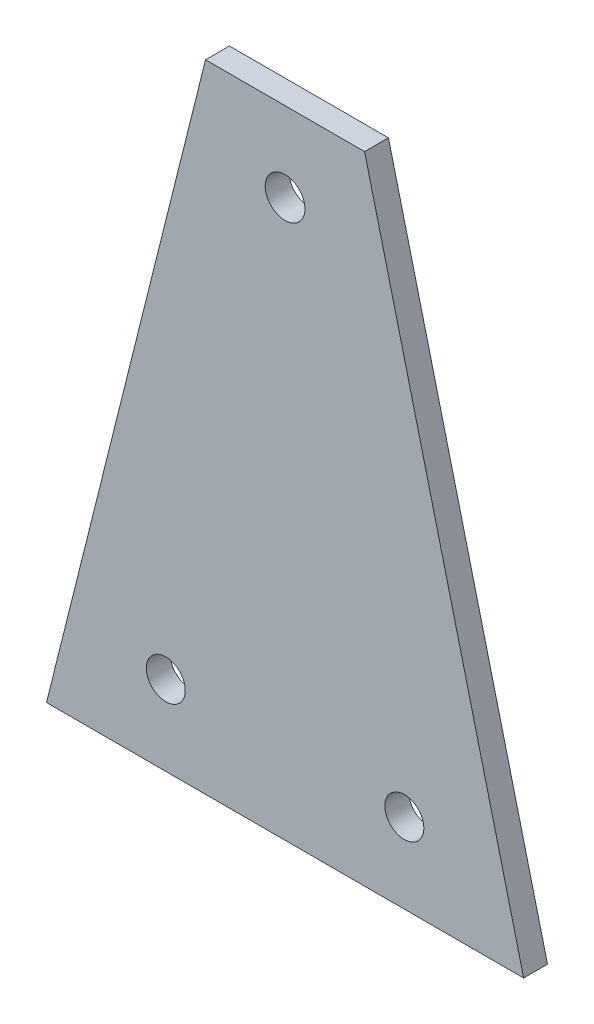
ISO-10303-21;
HEADER;
FILE_DESCRIPTION(('STEP AP214'),'2;1');
FILE_NAME('part.step','',(''),(''),'','','');
FILE_SCHEMA(('AUTOMOTIVE_DESIGN { 1 0 10303 214 1 1 1 1 }'));
ENDSEC;
DATA;
#1=APPLICATION_CONTEXT('core data for automotive mechanical design processes');
#2=APPLICATION_PROTOCOL_DEFINITION('international standard','automotive_design',2000,#1);
#3=PRODUCT_CONTEXT('',#1,'mechanical');
#4=PRODUCT('Part','Part','',(#3));
#5=PRODUCT_RELATED_PRODUCT_CATEGORY('part','',(#4));
#6=PRODUCT_DEFINITION_FORMATION('','',#4);
#7=PRODUCT_DEFINITION_CONTEXT('part definition',#1,'design');
#8=PRODUCT_DEFINITION('design','',#6,#7);
#9=PRODUCT_DEFINITION_SHAPE('','',#8);
#10=(LENGTH_UNIT() NAMED_UNIT(*) SI_UNIT(.MILLI.,.METRE.));
#11=(NAMED_UNIT(*) PLANE_ANGLE_UNIT() SI_UNIT($,.RADIAN.));
#12=(NAMED_UNIT(*) SI_UNIT($,.STERADIAN.) SOLID_ANGLE_UNIT());
#13=UNCERTAINTY_MEASURE_WITH_UNIT(LENGTH_MEASURE(1.E-05),#10,'distance_accuracy_value','');
#14=(GEOMETRIC_REPRESENTATION_CONTEXT(3) GLOBAL_UNCERTAINTY_ASSIGNED_CONTEXT((#13)) GLOBAL_UNIT_ASSIGNED_CONTEXT((#10,
#11,#12)) REPRESENTATION_CONTEXT('',''));
#15=CARTESIAN_POINT('',(0.,0.,0.));
#16=DIRECTION('',(0.,0.,1.));
#17=DIRECTION('',(1.,0.,0.));
#18=AXIS2_PLACEMENT_3D('',#15,#16,#17);
#19=CARTESIAN_POINT('',(0.,0.,3.));
#20=DIRECTION('',(0.,0.,-1.));
#21=DIRECTION('',(-1.,0.,0.));
#22=AXIS2_PLACEMENT_3D('',#19,#20,#21);
#23=PLANE('',#22);
#24=DIRECTION('',(-0.242535625036333,0.970142500145332,0.));
#25=VECTOR('',#24,1.);
#26=CARTESIAN_POINT('',(10.,0.,3.));
#27=LINE('',#26,#25);
#28=CARTESIAN_POINT('',(30.,-80.,3.));
#29=VERTEX_POINT('',#28);
#30=CARTESIAN_POINT('',(10.,0.,3.));
#31=VERTEX_POINT('',#30);
#32=EDGE_CURVE('E85',#29,#31,#27,.T.);
#33=ORIENTED_EDGE('',*,*,#32,.T.);
#34=DIRECTION('',(-1.,0.,0.));
#35=VECTOR('',#34,1.);
#36=CARTESIAN_POINT('',(-10.,0.,3.));
#37=LINE('',#36,#35);
#38=CARTESIAN_POINT('',(-10.,0.,3.));
#39=VERTEX_POINT('',#38);
#40=EDGE_CURVE('E80',#31,#39,#37,.T.);
#41=ORIENTED_EDGE('',*,*,#40,.T.);
#42=DIRECTION('',(-0.242535625036333,-0.970142500145332,0.));
#43=VECTOR('',#42,1.);
#44=CARTESIAN_POINT('',(-10.,0.,3.));
#45=LINE('',#44,#43);
#46=CARTESIAN_POINT('',(-30.,-80.,3.));
#47=VERTEX_POINT('',#46);
#48=EDGE_CURVE('E83',#39,#47,#45,.T.);
#49=ORIENTED_EDGE('',*,*,#48,.T.);
#50=DIRECTION('',(1.,0.,0.));
#51=VECTOR('',#50,1.);
#52=CARTESIAN_POINT('',(30.,-80.,3.));
#53=LINE('',#52,#51);
#54=EDGE_CURVE('E50',#47,#29,#53,.T.);
#55=ORIENTED_EDGE('',*,*,#54,.T.);
#56=EDGE_LOOP('',(#33,#41,#49,#55));
#57=FACE_BOUND('',#56,.T.);
#58=CARTESIAN_POINT('',(0.,-10.,3.));
#59=DIRECTION('',(0.,0.,1.));
#60=DIRECTION('',(1.,0.,0.));
#61=AXIS2_PLACEMENT_3D('',#58,#59,#60);
#62=CIRCLE('',#61,2.5);
#63=CARTESIAN_POINT('',(2.5,-10.,3.));
#64=VERTEX_POINT('',#63);
#65=EDGE_CURVE('E100',#64,#64,#62,.T.);
#66=ORIENTED_EDGE('',*,*,#65,.F.);
#67=EDGE_LOOP('',(#66));
#68=FACE_BOUND('',#67,.T.);
#69=CARTESIAN_POINT('',(15.,-69.97,3.));
#70=DIRECTION('',(0.,0.,1.));
#71=DIRECTION('',(1.,0.,0.));
#72=AXIS2_PLACEMENT_3D('',#69,#70,#71);
#73=CIRCLE('',#72,2.44999999999999);
#74=CARTESIAN_POINT('',(17.45,-69.97,3.));
#75=VERTEX_POINT('',#74);
#76=EDGE_CURVE('E115',#75,#75,#73,.T.);
#77=ORIENTED_EDGE('',*,*,#76,.F.);
#78=EDGE_LOOP('',(#77));
#79=FACE_BOUND('',#78,.T.);
#80=CARTESIAN_POINT('',(-15.,-69.97,3.));
#81=DIRECTION('',(0.,0.,1.));
#82=DIRECTION('',(-1.,0.,0.));
#83=AXIS2_PLACEMENT_3D('',#80,#81,#82);
#84=CIRCLE('',#83,2.44999999999999);
#85=CARTESIAN_POINT('',(-17.45,-69.97,3.));
#86=VERTEX_POINT('',#85);
#87=EDGE_CURVE('E121',#86,#86,#84,.T.);
#88=ORIENTED_EDGE('',*,*,#87,.F.);
#89=EDGE_LOOP('',(#88));
#90=FACE_BOUND('',#89,.T.);
#91=ADVANCED_FACE('F33',(#57,#68,#79,#90),#23,.F.);
#92=CARTESIAN_POINT('',(0.,0.,0.));
#93=DIRECTION('',(0.,0.,-1.));
#94=DIRECTION('',(-1.,0.,0.));
#95=AXIS2_PLACEMENT_3D('',#92,#93,#94);
#96=PLANE('',#95);
#97=CARTESIAN_POINT('',(15.,-69.97,0.));
#98=DIRECTION('',(0.,0.,1.));
#99=DIRECTION('',(1.,0.,0.));
#100=AXIS2_PLACEMENT_3D('',#97,#98,#99);
#101=CIRCLE('',#100,2.44999999999999);
#102=CARTESIAN_POINT('',(17.45,-69.97,0.));
#103=VERTEX_POINT('',#102);
#104=EDGE_CURVE('E118',#103,#103,#101,.T.);
#105=ORIENTED_EDGE('',*,*,#104,.T.);
#106=EDGE_LOOP('',(#105));
#107=FACE_BOUND('',#106,.T.);
#108=DIRECTION('',(-0.242535625036333,0.970142500145332,0.));
#109=VECTOR('',#108,1.);
#110=CARTESIAN_POINT('',(10.,0.,0.));
#111=LINE('',#110,#109);
#112=CARTESIAN_POINT('',(30.,-80.,0.));
#113=VERTEX_POINT('',#112);
#114=CARTESIAN_POINT('',(10.,0.,0.));
#115=VERTEX_POINT('',#114);
#116=EDGE_CURVE('E97',#113,#115,#111,.T.);
#117=ORIENTED_EDGE('',*,*,#116,.F.);
#118=DIRECTION('',(1.,0.,0.));
#119=VECTOR('',#118,1.);
#120=CARTESIAN_POINT('',(30.,-80.,0.));
#121=LINE('',#120,#119);
#122=CARTESIAN_POINT('',(-30.,-80.,0.));
#123=VERTEX_POINT('',#122);
#124=EDGE_CURVE('E73',#123,#113,#121,.T.);
#125=ORIENTED_EDGE('',*,*,#124,.F.);
#126=DIRECTION('',(-0.242535625036333,-0.970142500145332,0.));
#127=VECTOR('',#126,1.);
#128=CARTESIAN_POINT('',(-10.,0.,0.));
#129=LINE('',#128,#127);
#130=CARTESIAN_POINT('',(-10.,0.,0.));
#131=VERTEX_POINT('',#130);
#132=EDGE_CURVE('E67',#131,#123,#129,.T.);
#133=ORIENTED_EDGE('',*,*,#132,.F.);
#134=DIRECTION('',(-1.,0.,0.));
#135=VECTOR('',#134,1.);
#136=CARTESIAN_POINT('',(-10.,0.,0.));
#137=LINE('',#136,#135);
#138=EDGE_CURVE('E89',#115,#131,#137,.T.);
#139=ORIENTED_EDGE('',*,*,#138,.F.);
#140=EDGE_LOOP('',(#117,#125,#133,#139));
#141=FACE_BOUND('',#140,.T.);
#142=CARTESIAN_POINT('',(0.,-10.,0.));
#143=DIRECTION('',(0.,0.,1.));
#144=DIRECTION('',(1.,0.,0.));
#145=AXIS2_PLACEMENT_3D('',#142,#143,#144);
#146=CIRCLE('',#145,2.5);
#147=CARTESIAN_POINT('',(2.5,-10.,0.));
#148=VERTEX_POINT('',#147);
#149=EDGE_CURVE('E112',#148,#148,#146,.T.);
#150=ORIENTED_EDGE('',*,*,#149,.T.);
#151=EDGE_LOOP('',(#150));
#152=FACE_BOUND('',#151,.T.);
#153=CARTESIAN_POINT('',(-15.,-69.97,0.));
#154=DIRECTION('',(0.,0.,1.));
#155=DIRECTION('',(-1.,0.,0.));
#156=AXIS2_PLACEMENT_3D('',#153,#154,#155);
#157=CIRCLE('',#156,2.44999999999999);
#158=CARTESIAN_POINT('',(-17.45,-69.97,0.));
#159=VERTEX_POINT('',#158);
#160=EDGE_CURVE('E124',#159,#159,#157,.T.);
#161=ORIENTED_EDGE('',*,*,#160,.T.);
#162=EDGE_LOOP('',(#161));
#163=FACE_BOUND('',#162,.T.);
#164=ADVANCED_FACE('F108',(#107,#141,#152,#163),#96,.T.);
#165=CARTESIAN_POINT('',(10.,0.,3.));
#166=DIRECTION('',(-0.970142500145332,-0.242535625036333,0.));
#167=DIRECTION('',(0.242535625036333,-0.970142500145332,0.));
#168=AXIS2_PLACEMENT_3D('',#165,#166,#167);
#169=PLANE('',#168);
#170=ORIENTED_EDGE('',*,*,#116,.T.);
#171=DIRECTION('',(0.,0.,-1.));
#172=VECTOR('',#171,1.);
#173=CARTESIAN_POINT('',(10.,0.,3.));
#174=LINE('',#173,#172);
#175=EDGE_CURVE('E11',#31,#115,#174,.T.);
#176=ORIENTED_EDGE('',*,*,#175,.F.);
#177=ORIENTED_EDGE('',*,*,#32,.F.);
#178=DIRECTION('',(0.,0.,-1.));
#179=VECTOR('',#178,1.);
#180=CARTESIAN_POINT('',(30.,-80.,3.));
#181=LINE('',#180,#179);
#182=EDGE_CURVE('E93',#29,#113,#181,.T.);
#183=ORIENTED_EDGE('',*,*,#182,.T.);
#184=EDGE_LOOP('',(#170,#176,#177,#183));
#185=FACE_BOUND('',#184,.T.);
#186=ADVANCED_FACE('F35',(#185),#169,.F.);
#187=CARTESIAN_POINT('',(-10.,0.,3.));
#188=DIRECTION('',(0.,-1.,0.));
#189=DIRECTION('',(0.,0.,-1.));
#190=AXIS2_PLACEMENT_3D('',#187,#188,#189);
#191=PLANE('',#190);
#192=ORIENTED_EDGE('',*,*,#138,.T.);
#193=DIRECTION('',(0.,0.,-1.));
#194=VECTOR('',#193,1.);
#195=CARTESIAN_POINT('',(-10.,0.,3.));
#196=LINE('',#195,#194);
#197=EDGE_CURVE('E42',#39,#131,#196,.T.);
#198=ORIENTED_EDGE('',*,*,#197,.F.);
#199=ORIENTED_EDGE('',*,*,#40,.F.);
#200=ORIENTED_EDGE('',*,*,#175,.T.);
#201=EDGE_LOOP('',(#192,#198,#199,#200));
#202=FACE_BOUND('',#201,.T.);
#203=ADVANCED_FACE('F88',(#202),#191,.F.);
#204=CARTESIAN_POINT('',(-10.,0.,3.));
#205=DIRECTION('',(0.970142500145332,-0.242535625036333,0.));
#206=DIRECTION('',(0.242535625036333,0.970142500145332,0.));
#207=AXIS2_PLACEMENT_3D('',#204,#205,#206);
#208=PLANE('',#207);
#209=ORIENTED_EDGE('',*,*,#132,.T.);
#210=DIRECTION('',(0.,0.,-1.));
#211=VECTOR('',#210,1.);
#212=CARTESIAN_POINT('',(-30.,-80.,3.));
#213=LINE('',#212,#211);
#214=EDGE_CURVE('E90',#47,#123,#213,.T.);
#215=ORIENTED_EDGE('',*,*,#214,.F.);
#216=ORIENTED_EDGE('',*,*,#48,.F.);
#217=ORIENTED_EDGE('',*,*,#197,.T.);
#218=EDGE_LOOP('',(#209,#215,#216,#217));
#219=FACE_BOUND('',#218,.T.);
#220=ADVANCED_FACE('F91',(#219),#208,.F.);
#221=CARTESIAN_POINT('',(30.,-80.,3.));
#222=DIRECTION('',(0.,1.,0.));
#223=DIRECTION('',(0.,0.,1.));
#224=AXIS2_PLACEMENT_3D('',#221,#222,#223);
#225=PLANE('',#224);
#226=ORIENTED_EDGE('',*,*,#124,.T.);
#227=ORIENTED_EDGE('',*,*,#182,.F.);
#228=ORIENTED_EDGE('',*,*,#54,.F.);
#229=ORIENTED_EDGE('',*,*,#214,.T.);
#230=EDGE_LOOP('',(#226,#227,#228,#229));
#231=FACE_BOUND('',#230,.T.);
#232=ADVANCED_FACE('F105',(#231),#225,.F.);
#233=CARTESIAN_POINT('',(0.,-10.,3.));
#234=DIRECTION('',(0.,0.,-1.));
#235=DIRECTION('',(-1.,0.,0.));
#236=AXIS2_PLACEMENT_3D('',#233,#234,#235);
#237=CYLINDRICAL_SURFACE('',#236,2.5);
#238=ORIENTED_EDGE('',*,*,#65,.T.);
#239=EDGE_LOOP('',(#238));
#240=FACE_BOUND('',#239,.T.);
#241=ORIENTED_EDGE('',*,*,#149,.F.);
#242=EDGE_LOOP('',(#241));
#243=FACE_BOUND('',#242,.T.);
#244=ADVANCED_FACE('F141',(#240,#243),#237,.F.);
#245=CARTESIAN_POINT('',(15.,-69.97,3.));
#246=DIRECTION('',(0.,0.,-1.));
#247=DIRECTION('',(-1.,0.,0.));
#248=AXIS2_PLACEMENT_3D('',#245,#246,#247);
#249=CYLINDRICAL_SURFACE('',#248,2.44999999999999);
#250=ORIENTED_EDGE('',*,*,#76,.T.);
#251=EDGE_LOOP('',(#250));
#252=FACE_BOUND('',#251,.T.);
#253=ORIENTED_EDGE('',*,*,#104,.F.);
#254=EDGE_LOOP('',(#253));
#255=FACE_BOUND('',#254,.T.);
#256=ADVANCED_FACE('F187',(#252,#255),#249,.F.);
#257=CARTESIAN_POINT('',(-15.,-69.97,3.));
#258=DIRECTION('',(0.,0.,-1.));
#259=DIRECTION('',(-1.,0.,0.));
#260=AXIS2_PLACEMENT_3D('',#257,#258,#259);
#261=CYLINDRICAL_SURFACE('',#260,2.44999999999999);
#262=ORIENTED_EDGE('',*,*,#87,.T.);
#263=EDGE_LOOP('',(#262));
#264=FACE_BOUND('',#263,.T.);
#265=ORIENTED_EDGE('',*,*,#160,.F.);
#266=EDGE_LOOP('',(#265));
#267=FACE_BOUND('',#266,.T.);
#268=ADVANCED_FACE('F130',(#264,#267),#261,.F.);
#269=CLOSED_SHELL('',(#91,#164,#186,#203,#220,#232,#244,#256,#268));
#270=MANIFOLD_SOLID_BREP('B2',#269);
#271=ADVANCED_BREP_SHAPE_REPRESENTATION('',(#18,#270),#14);
#272=SHAPE_DEFINITION_REPRESENTATION(#9,#271);
ENDSEC;
END-ISO-10303-21;
